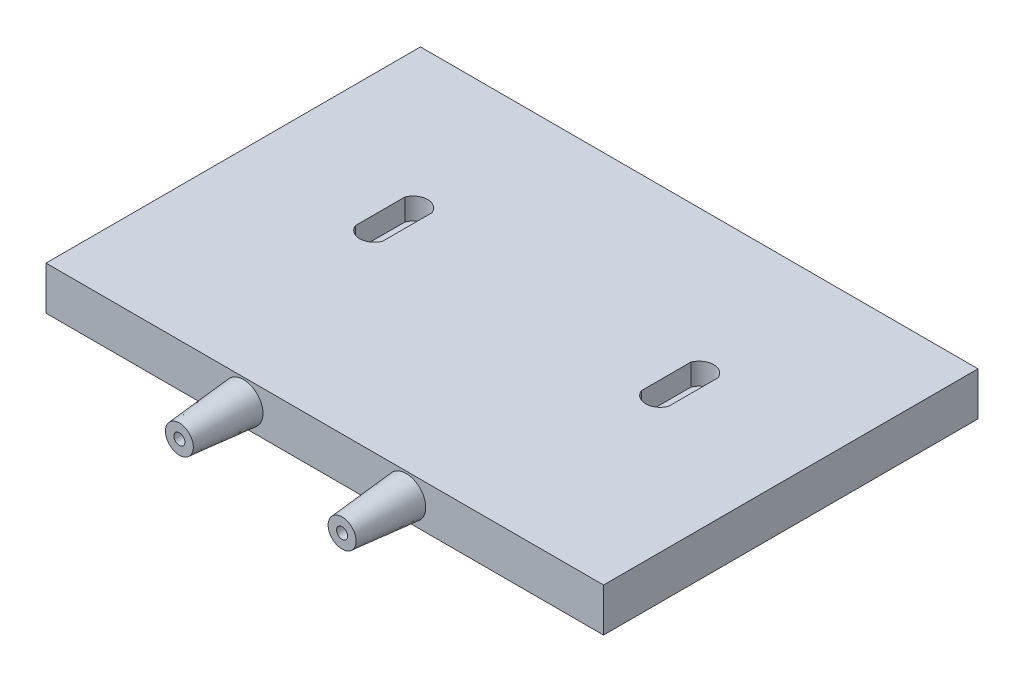
ISO-10303-21;
HEADER;
FILE_DESCRIPTION(('STEP AP214'),'2;1');
FILE_NAME('part.step','',(''),(''),'','','');
FILE_SCHEMA(('AUTOMOTIVE_DESIGN { 1 0 10303 214 1 1 1 1 }'));
ENDSEC;
DATA;
#1=APPLICATION_CONTEXT('core data for automotive mechanical design processes');
#2=APPLICATION_PROTOCOL_DEFINITION('international standard','automotive_design',2000,#1);
#3=PRODUCT_CONTEXT('',#1,'mechanical');
#4=PRODUCT('Part','Part','',(#3));
#5=PRODUCT_RELATED_PRODUCT_CATEGORY('part','',(#4));
#6=PRODUCT_DEFINITION_FORMATION('','',#4);
#7=PRODUCT_DEFINITION_CONTEXT('part definition',#1,'design');
#8=PRODUCT_DEFINITION('design','',#6,#7);
#9=PRODUCT_DEFINITION_SHAPE('','',#8);
#10=(LENGTH_UNIT() NAMED_UNIT(*) SI_UNIT(.MILLI.,.METRE.));
#11=(NAMED_UNIT(*) PLANE_ANGLE_UNIT() SI_UNIT($,.RADIAN.));
#12=(NAMED_UNIT(*) SI_UNIT($,.STERADIAN.) SOLID_ANGLE_UNIT());
#13=UNCERTAINTY_MEASURE_WITH_UNIT(LENGTH_MEASURE(1.E-05),#10,'distance_accuracy_value','');
#14=(GEOMETRIC_REPRESENTATION_CONTEXT(3) GLOBAL_UNCERTAINTY_ASSIGNED_CONTEXT((#13)) GLOBAL_UNIT_ASSIGNED_CONTEXT((#10,
#11,#12)) REPRESENTATION_CONTEXT('',''));
#15=CARTESIAN_POINT('',(0.,0.,0.));
#16=DIRECTION('',(0.,0.,1.));
#17=DIRECTION('',(1.,0.,0.));
#18=AXIS2_PLACEMENT_3D('',#15,#16,#17);
#19=CARTESIAN_POINT('',(-22.8749999999999,6.1,52.6359973136333));
#20=DIRECTION('',(0.,0.,-1.));
#21=DIRECTION('',(1.,0.,0.));
#22=AXIS2_PLACEMENT_3D('',#19,#20,#21);
#23=CONICAL_SURFACE('',#22,5.5,0.0872664625997165);
#24=CARTESIAN_POINT('',(-22.8749999999999,6.1,52.6359973136333));
#25=DIRECTION('',(0.,0.,-1.));
#26=DIRECTION('',(-1.,0.,0.));
#27=AXIS2_PLACEMENT_3D('',#24,#25,#26);
#28=CIRCLE('',#27,5.5);
#29=CARTESIAN_POINT('',(-28.3749999999999,6.1,52.6359973136333));
#30=VERTEX_POINT('',#29);
#31=EDGE_CURVE('E352',#30,#30,#28,.F.);
#32=ORIENTED_EDGE('',*,*,#31,.T.);
#33=EDGE_LOOP('',(#32));
#34=FACE_BOUND('',#33,.T.);
#35=CARTESIAN_POINT('',(-22.8749999999999,6.1,70.6359973136333));
#36=DIRECTION('',(0.,0.,1.));
#37=DIRECTION('',(1.,0.,0.));
#38=AXIS2_PLACEMENT_3D('',#35,#36,#37);
#39=CIRCLE('',#38,3.92520405653336);
#40=CARTESIAN_POINT('',(-18.9497959434666,6.1,70.6359973136333));
#41=VERTEX_POINT('',#40);
#42=EDGE_CURVE('E256',#41,#41,#39,.T.);
#43=ORIENTED_EDGE('',*,*,#42,.F.);
#44=EDGE_LOOP('',(#43));
#45=FACE_BOUND('',#44,.T.);
#46=CARTESIAN_POINT('',(-26.3749999999999,4.17210871809767,69.8285854690584));
#47=CARTESIAN_POINT('',(-26.3749999999999,4.11745942982969,69.5269976381816));
#48=CARTESIAN_POINT('',(-26.3749999999999,4.06446248035971,69.2251163527461));
#49=CARTESIAN_POINT('',(-26.3749999999999,3.96123087004707,68.6208892731655));
#50=CARTESIAN_POINT('',(-26.3749999999999,3.9109961356524,68.3185434916094));
#51=CARTESIAN_POINT('',(-26.3749999999999,3.81274798337831,67.7135200384658));
#52=CARTESIAN_POINT('',(-26.3749999999999,3.76473437277168,67.4108423980156));
#53=CARTESIAN_POINT('',(-26.3749999999999,3.67056684298433,66.8051961446706));
#54=CARTESIAN_POINT('',(-26.3749999999999,3.62441293829521,66.5022275295271));
#55=CARTESIAN_POINT('',(-26.3749999999999,3.48831477248816,65.5930914334059));
#56=CARTESIAN_POINT('',(-26.3749999999999,3.40071471504929,64.9865729981366));
#57=CARTESIAN_POINT('',(-26.3749999999999,3.23016743796715,63.7728702574676));
#58=CARTESIAN_POINT('',(-26.3749999999999,3.14722034779906,63.1656859340175));
#59=CARTESIAN_POINT('',(-26.3749999999999,2.98491601388755,61.950561728038));
#60=CARTESIAN_POINT('',(-26.3749999999999,2.90556039647342,61.3426216288001));
#61=CARTESIAN_POINT('',(-26.3749999999999,2.74975750285684,60.126368515576));
#62=CARTESIAN_POINT('',(-26.3749999999999,2.67331023423791,59.5180555006216));
#63=CARTESIAN_POINT('',(-26.3749999999999,2.44750949646066,57.6926767682325));
#64=CARTESIAN_POINT('',(-26.3749999999999,2.30169733858322,56.4751732114865));
#65=CARTESIAN_POINT('',(-26.3749999999999,2.01663971682371,54.0389161870429));
#66=CARTESIAN_POINT('',(-26.3749999999999,1.87739686896342,52.8201624156162));
#67=CARTESIAN_POINT('',(-26.3749999999999,1.67224553648955,50.9916372554584));
#68=CARTESIAN_POINT('',(-26.3749999999999,1.6044816752983,50.3820732311682));
#69=CARTESIAN_POINT('',(-26.3749999999999,1.47004371275973,49.162826215269));
#70=CARTESIAN_POINT('',(-26.3749999999999,1.40336960922725,48.5531432239012));
#71=CARTESIAN_POINT('',(-26.3749999999999,1.33716672483393,47.9434091582082));
#72=B_SPLINE_CURVE_WITH_KNOTS('',3,(#46,#47,#48,#49,#50,#51,#52,#53,#54,#55,#56,#57,#58,#59,#60,
#61,#62,#63,#64,#65,#66,#67,#68,#69,#70,#71),.UNSPECIFIED.,.F.,.F.,(4,2,2,2,2,2,2,2,2,2,2,2,4),
(0.,0.91948455837307,1.83894462092231,2.75832475157389,3.67771204503739,5.51611992035932,
7.3545789265392,9.19386227997452,11.0331504290127,14.7117323193549,18.3917669342644,
20.2317232111315,22.0716757980903),.UNSPECIFIED.);
#73=CARTESIAN_POINT('',(-26.3749999999999,2.81505393507992,60.6359973136333));
#74=VERTEX_POINT('',#73);
#75=CARTESIAN_POINT('',(-26.3749999999999,2.38189429319995,57.1359973136333));
#76=VERTEX_POINT('',#75);
#77=EDGE_CURVE('E11',#74,#76,#72,.T.);
#78=ORIENTED_EDGE('',*,*,#77,.F.);
#79=CARTESIAN_POINT('',(-22.8749999999999,6.1,60.6359973136333));
#80=DIRECTION('',(0.,0.,-1.));
#81=DIRECTION('',(-1.,0.,0.));
#82=AXIS2_PLACEMENT_3D('',#79,#80,#81);
#83=CIRCLE('',#82,4.8000906917926);
#84=CARTESIAN_POINT('',(-19.3749999999999,2.81505393507991,60.6359973136333));
#85=VERTEX_POINT('',#84);
#86=EDGE_CURVE('E198',#85,#74,#83,.T.);
#87=ORIENTED_EDGE('',*,*,#86,.F.);
#88=CARTESIAN_POINT('',(-19.3749999999999,1.33716672483392,47.9434091582082));
#89=CARTESIAN_POINT('',(-19.3749999999999,1.43500962840932,48.844351854817));
#90=CARTESIAN_POINT('',(-19.3749999999999,1.53384689658539,49.7451881265944));
#91=CARTESIAN_POINT('',(-19.3749999999999,1.73406321961327,51.5465669491305));
#92=CARTESIAN_POINT('',(-19.3749999999999,1.83544224393583,52.4471095032856));
#93=CARTESIAN_POINT('',(-19.3749999999999,2.04127619907767,54.2476556788387));
#94=CARTESIAN_POINT('',(-19.3749999999999,2.14573049022473,55.1476593731346));
#95=CARTESIAN_POINT('',(-19.3749999999999,2.35855843869986,56.9472195360648));
#96=CARTESIAN_POINT('',(-19.3749999999999,2.46693216248866,57.846775996853));
#97=CARTESIAN_POINT('',(-19.3749999999999,2.69205036720925,59.6720549838711));
#98=CARTESIAN_POINT('',(-19.3749999999999,2.80894803278661,60.5977587568576));
#99=CARTESIAN_POINT('',(-19.3749999999999,2.98981211234068,61.9855761544224));
#100=CARTESIAN_POINT('',(-19.3749999999999,3.0510184308723,62.4480494832672));
#101=CARTESIAN_POINT('',(-19.3749999999999,3.17564137614589,63.3727017550615));
#102=CARTESIAN_POINT('',(-19.3749999999999,3.23905801587242,63.8348806962655));
#103=CARTESIAN_POINT('',(-19.3749999999999,3.36858423900071,64.758971624193));
#104=CARTESIAN_POINT('',(-19.3749999999999,3.43469444400984,65.2208835240601));
#105=CARTESIAN_POINT('',(-19.3749999999999,3.57024116419512,66.1442126160202));
#106=CARTESIAN_POINT('',(-19.3749999999999,3.6396776245076,66.6056298161447));
#107=CARTESIAN_POINT('',(-19.3749999999999,3.78280263295804,67.5278740895825));
#108=CARTESIAN_POINT('',(-19.3749999999999,3.85649176054285,67.9887010736904));
#109=CARTESIAN_POINT('',(-19.3749999999999,3.97126229074893,68.6792510157885));
#110=CARTESIAN_POINT('',(-19.3749999999999,4.01022642101928,68.9093256550331));
#111=CARTESIAN_POINT('',(-19.3749999999999,4.08983772132458,69.3691868112572));
#112=CARTESIAN_POINT('',(-19.3749999999999,4.130484916852,69.5989733238181));
#113=CARTESIAN_POINT('',(-19.3749999999999,4.17210871809766,69.8285854690584));
#114=B_SPLINE_CURVE_WITH_KNOTS('',3,(#88,#89,#90,#91,#92,#93,#94,#95,#96,#97,#98,#99,#100,#101,
#102,#103,#104,#105,#106,#107,#108,#109,#110,#111,#112,#113),.UNSPECIFIED.,.F.,.F.,(4,2,2,2,2,2,
2,2,2,2,2,2,4),(0.,2.7187218020045,5.43741096484029,8.15553856620453,10.8737122797325,
13.6728538729671,15.0723675720148,16.4718894939034,17.8717362403286,19.2715599054532,
20.6715747558415,21.3716212738195,22.0716783989049),.UNSPECIFIED.);
#115=CARTESIAN_POINT('',(-19.3749999999999,2.38189429319994,57.1359973136333));
#116=VERTEX_POINT('',#115);
#117=EDGE_CURVE('E50',#116,#85,#114,.T.);
#118=ORIENTED_EDGE('',*,*,#117,.F.);
#119=CARTESIAN_POINT('',(-22.8749999999999,6.1,57.1359973136333));
#120=DIRECTION('',(0.,0.,1.));
#121=DIRECTION('',(1.,0.,0.));
#122=AXIS2_PLACEMENT_3D('',#119,#120,#121);
#123=CIRCLE('',#122,5.10630101413334);
#124=EDGE_CURVE('E203',#76,#116,#123,.T.);
#125=ORIENTED_EDGE('',*,*,#124,.F.);
#126=EDGE_LOOP('',(#78,#87,#118,#125));
#127=FACE_BOUND('',#126,.T.);
#128=ADVANCED_FACE('F36',(#34,#45,#127),#23,.T.);
#129=CARTESIAN_POINT('',(22.875,6.10000000000021,52.6359973136333));
#130=DIRECTION('',(0.,0.,-1.));
#131=DIRECTION('',(-1.,0.,0.));
#132=AXIS2_PLACEMENT_3D('',#129,#130,#131);
#133=CONICAL_SURFACE('',#132,5.5,0.0872664625997165);
#134=CARTESIAN_POINT('',(22.875,6.10000000000021,70.6359973136333));
#135=DIRECTION('',(0.,0.,-1.));
#136=DIRECTION('',(-1.,0.,0.));
#137=AXIS2_PLACEMENT_3D('',#134,#135,#136);
#138=CIRCLE('',#137,3.92520405653336);
#139=CARTESIAN_POINT('',(18.9497959434666,6.10000000000021,70.6359973136333));
#140=VERTEX_POINT('',#139);
#141=EDGE_CURVE('E246',#140,#140,#138,.T.);
#142=ORIENTED_EDGE('',*,*,#141,.T.);
#143=EDGE_LOOP('',(#142));
#144=FACE_BOUND('',#143,.T.);
#145=CARTESIAN_POINT('',(22.875,6.10000000000021,52.6359973136333));
#146=DIRECTION('',(0.,0.,-1.));
#147=DIRECTION('',(-1.,0.,0.));
#148=AXIS2_PLACEMENT_3D('',#145,#146,#147);
#149=CIRCLE('',#148,5.5);
#150=CARTESIAN_POINT('',(17.375,6.10000000000021,52.6359973136333));
#151=VERTEX_POINT('',#150);
#152=EDGE_CURVE('E253',#151,#151,#149,.T.);
#153=ORIENTED_EDGE('',*,*,#152,.F.);
#154=EDGE_LOOP('',(#153));
#155=FACE_BOUND('',#154,.T.);
#156=CARTESIAN_POINT('',(19.3749999999999,1.33716672483419,47.9434091582084));
#157=CARTESIAN_POINT('',(19.3749999999999,1.4350096284096,48.8443518548172));
#158=CARTESIAN_POINT('',(19.3749999999999,1.53384689658566,49.7451881265946));
#159=CARTESIAN_POINT('',(19.3749999999999,1.73406321961355,51.5465669491307));
#160=CARTESIAN_POINT('',(19.3749999999999,1.83544224393611,52.4471095032858));
#161=CARTESIAN_POINT('',(19.3749999999999,2.04127619907795,54.2476556788389));
#162=CARTESIAN_POINT('',(19.3749999999999,2.145730490225,55.1476593731347));
#163=CARTESIAN_POINT('',(19.3749999999999,2.35855843870014,56.9472195360649));
#164=CARTESIAN_POINT('',(19.3749999999999,2.46693216248894,57.8467759968532));
#165=CARTESIAN_POINT('',(19.3749999999999,2.69205036720953,59.6720549838712));
#166=CARTESIAN_POINT('',(19.3749999999999,2.80894803278689,60.5977587568577));
#167=CARTESIAN_POINT('',(19.3749999999999,2.98981211234096,61.9855761544225));
#168=CARTESIAN_POINT('',(19.3749999999999,3.05101843087257,62.4480494832672));
#169=CARTESIAN_POINT('',(19.3749999999999,3.17564137614617,63.3727017550616));
#170=CARTESIAN_POINT('',(19.3749999999999,3.2390580158727,63.8348806962656));
#171=CARTESIAN_POINT('',(19.3749999999999,3.36858423900098,64.758971624193));
#172=CARTESIAN_POINT('',(19.3749999999999,3.43469444401012,65.22088352406));
#173=CARTESIAN_POINT('',(19.3749999999999,3.5702411641954,66.1442126160201));
#174=CARTESIAN_POINT('',(19.3749999999999,3.63967762450788,66.6056298161446));
#175=CARTESIAN_POINT('',(19.3749999999999,3.78280263295832,67.5278740895824));
#176=CARTESIAN_POINT('',(19.3749999999999,3.85649176054313,67.9887010736903));
#177=CARTESIAN_POINT('',(19.3749999999999,3.97126229074921,68.6792510157883));
#178=CARTESIAN_POINT('',(19.3749999999999,4.01022642101956,68.909325655033));
#179=CARTESIAN_POINT('',(19.3749999999999,4.08983772132486,69.369186811257));
#180=CARTESIAN_POINT('',(19.3749999999999,4.13048491685228,69.598973323818));
#181=CARTESIAN_POINT('',(19.3749999999999,4.17210871809794,69.8285854690583));
#182=B_SPLINE_CURVE_WITH_KNOTS('',3,(#156,#157,#158,#159,#160,#161,#162,#163,#164,#165,#166,
#167,#168,#169,#170,#171,#172,#173,#174,#175,#176,#177,#178,#179,#180,#181),.UNSPECIFIED.,.F.,
.F.,(4,2,2,2,2,2,2,2,2,2,2,2,4),(0.,2.7187218020045,5.43741096484028,8.1555385662045,
10.8737122797325,13.672853872967,15.0723675720146,16.4718894939032,17.8717362403284,
19.2715599054529,20.6715747558411,21.3716212738192,22.0716783989045),.UNSPECIFIED.);
#183=CARTESIAN_POINT('',(19.3749999999999,2.3818942932002,57.1359973136333));
#184=VERTEX_POINT('',#183);
#185=CARTESIAN_POINT('',(19.3749999999999,2.81505393508006,60.6359973136334));
#186=VERTEX_POINT('',#185);
#187=EDGE_CURVE('E354',#184,#186,#182,.T.);
#188=ORIENTED_EDGE('',*,*,#187,.T.);
#189=CARTESIAN_POINT('',(22.875,6.10000000000021,60.6359973136333));
#190=DIRECTION('',(0.,0.,-1.));
#191=DIRECTION('',(-1.,0.,0.));
#192=AXIS2_PLACEMENT_3D('',#189,#190,#191);
#193=CIRCLE('',#192,4.8000906917926);
#194=CARTESIAN_POINT('',(26.3749999999999,2.81505393508006,60.6359973136333));
#195=VERTEX_POINT('',#194);
#196=EDGE_CURVE('E235',#186,#195,#193,.F.);
#197=ORIENTED_EDGE('',*,*,#196,.T.);
#198=CARTESIAN_POINT('',(26.3749999999999,4.17210871809775,69.8285854690582));
#199=CARTESIAN_POINT('',(26.3749999999999,4.11745942982977,69.5269976381814));
#200=CARTESIAN_POINT('',(26.3749999999999,4.06446248035979,69.2251163527459));
#201=CARTESIAN_POINT('',(26.3749999999999,3.96123087004716,68.6208892731653));
#202=CARTESIAN_POINT('',(26.3749999999999,3.91099613565249,68.3185434916092));
#203=CARTESIAN_POINT('',(26.3749999999999,3.8127479833784,67.7135200384656));
#204=CARTESIAN_POINT('',(26.3749999999999,3.76473437277178,67.4108423980154));
#205=CARTESIAN_POINT('',(26.3749999999999,3.67056684298443,66.8051961446704));
#206=CARTESIAN_POINT('',(26.3749999999999,3.62441293829532,66.5022275295269));
#207=CARTESIAN_POINT('',(26.3749999999999,3.48831477248826,65.5930914334057));
#208=CARTESIAN_POINT('',(26.3749999999999,3.40071471504939,64.9865729981364));
#209=CARTESIAN_POINT('',(26.3749999999999,3.23016743796727,63.7728702574674));
#210=CARTESIAN_POINT('',(26.3749999999999,3.14722034779917,63.1656859340173));
#211=CARTESIAN_POINT('',(26.3749999999999,2.98491601388767,61.9505617280378));
#212=CARTESIAN_POINT('',(26.3749999999999,2.90556039647355,61.3426216287999));
#213=CARTESIAN_POINT('',(26.3749999999999,2.74975750285697,60.1263685155759));
#214=CARTESIAN_POINT('',(26.3749999999999,2.67331023423804,59.5180555006215));
#215=CARTESIAN_POINT('',(26.3749999999999,2.4475094964608,57.6926767682324));
#216=CARTESIAN_POINT('',(26.3749999999999,2.30169733858338,56.4751732114864));
#217=CARTESIAN_POINT('',(26.3749999999999,2.01663971682388,54.0389161870429));
#218=CARTESIAN_POINT('',(26.3749999999999,1.87739686896359,52.8201624156163));
#219=CARTESIAN_POINT('',(26.3749999999999,1.67224553648973,50.9916372554585));
#220=CARTESIAN_POINT('',(26.3749999999999,1.60448167529848,50.3820732311683));
#221=CARTESIAN_POINT('',(26.3749999999999,1.47004371275992,49.1628262152692));
#222=CARTESIAN_POINT('',(26.3749999999999,1.40336960922744,48.5531432239014));
#223=CARTESIAN_POINT('',(26.3749999999999,1.33716672483412,47.9434091582084));
#224=B_SPLINE_CURVE_WITH_KNOTS('',3,(#198,#199,#200,#201,#202,#203,#204,#205,#206,#207,#208,
#209,#210,#211,#212,#213,#214,#215,#216,#217,#218,#219,#220,#221,#222,#223),.UNSPECIFIED.,.F.,
.F.,(4,2,2,2,2,2,2,2,2,2,2,2,4),(0.,0.919484558373068,1.8389446209223,2.7583247515739,
3.67771204503739,5.51611992035932,7.35457892653922,9.19386227997449,11.0331504290126,
14.7117323193547,18.3917669342641,20.2317232111311,22.0716757980899),.UNSPECIFIED.);
#225=CARTESIAN_POINT('',(26.3749999999999,2.38189429320011,57.1359973136333));
#226=VERTEX_POINT('',#225);
#227=EDGE_CURVE('E370',#195,#226,#224,.T.);
#228=ORIENTED_EDGE('',*,*,#227,.T.);
#229=CARTESIAN_POINT('',(22.875,6.10000000000021,57.1359973136333));
#230=DIRECTION('',(0.,0.,1.));
#231=DIRECTION('',(1.,0.,0.));
#232=AXIS2_PLACEMENT_3D('',#229,#230,#231);
#233=CIRCLE('',#232,5.10630101413334);
#234=EDGE_CURVE('E231',#226,#184,#233,.F.);
#235=ORIENTED_EDGE('',*,*,#234,.T.);
#236=EDGE_LOOP('',(#188,#197,#228,#235));
#237=FACE_BOUND('',#236,.T.);
#238=ADVANCED_FACE('F376',(#144,#155,#237),#133,.T.);
#239=CARTESIAN_POINT('',(22.8750000000001,6.1,70.6369973136333));
#240=DIRECTION('',(0.,0.,-1.));
#241=DIRECTION('',(-1.,0.,0.));
#242=AXIS2_PLACEMENT_3D('',#239,#240,#241);
#243=CYLINDRICAL_SURFACE('',#242,1.55);
#244=CARTESIAN_POINT('',(22.8750000000001,6.1,70.6359973136333));
#245=DIRECTION('',(0.,0.,-1.));
#246=DIRECTION('',(-1.,0.,0.));
#247=AXIS2_PLACEMENT_3D('',#244,#245,#246);
#248=CIRCLE('',#247,1.55);
#249=CARTESIAN_POINT('',(21.3250000000001,6.1,70.6359973136333));
#250=VERTEX_POINT('',#249);
#251=EDGE_CURVE('E238',#250,#250,#248,.T.);
#252=ORIENTED_EDGE('',*,*,#251,.F.);
#253=EDGE_LOOP('',(#252));
#254=FACE_BOUND('',#253,.T.);
#255=CARTESIAN_POINT('',(22.8750000000001,6.1,60.6359973136333));
#256=DIRECTION('',(0.,0.,-1.));
#257=DIRECTION('',(-1.,0.,0.));
#258=AXIS2_PLACEMENT_3D('',#255,#256,#257);
#259=CIRCLE('',#258,1.55);
#260=CARTESIAN_POINT('',(21.3250000000001,6.1,60.6359973136333));
#261=VERTEX_POINT('',#260);
#262=EDGE_CURVE('E234',#261,#261,#259,.T.);
#263=ORIENTED_EDGE('',*,*,#262,.T.);
#264=EDGE_LOOP('',(#263));
#265=FACE_BOUND('',#264,.T.);
#266=ADVANCED_FACE('F407',(#254,#265),#243,.F.);
#267=CARTESIAN_POINT('',(-22.8749999999999,6.1,70.6369973136333));
#268=DIRECTION('',(0.,0.,-1.));
#269=DIRECTION('',(-1.,0.,0.));
#270=AXIS2_PLACEMENT_3D('',#267,#268,#269);
#271=CYLINDRICAL_SURFACE('',#270,1.55);
#272=CARTESIAN_POINT('',(-22.8749999999999,6.1,70.6359973136333));
#273=DIRECTION('',(0.,0.,1.));
#274=DIRECTION('',(1.,0.,0.));
#275=AXIS2_PLACEMENT_3D('',#272,#273,#274);
#276=CIRCLE('',#275,1.55);
#277=CARTESIAN_POINT('',(-21.3249999999999,6.1,70.6359973136333));
#278=VERTEX_POINT('',#277);
#279=EDGE_CURVE('E242',#278,#278,#276,.T.);
#280=ORIENTED_EDGE('',*,*,#279,.T.);
#281=EDGE_LOOP('',(#280));
#282=FACE_BOUND('',#281,.T.);
#283=CARTESIAN_POINT('',(-22.8749999999999,6.1,60.6359973136333));
#284=DIRECTION('',(0.,0.,-1.));
#285=DIRECTION('',(-1.,0.,0.));
#286=AXIS2_PLACEMENT_3D('',#283,#284,#285);
#287=CIRCLE('',#286,1.55);
#288=CARTESIAN_POINT('',(-24.4249999999999,6.1,60.6359973136333));
#289=VERTEX_POINT('',#288);
#290=EDGE_CURVE('E228',#289,#289,#287,.T.);
#291=ORIENTED_EDGE('',*,*,#290,.T.);
#292=EDGE_LOOP('',(#291));
#293=FACE_BOUND('',#292,.T.);
#294=ADVANCED_FACE('F403',(#282,#293),#271,.F.);
#295=CARTESIAN_POINT('',(0.,12.2,0.));
#296=DIRECTION('',(0.,1.,0.));
#297=DIRECTION('',(0.,0.,1.));
#298=AXIS2_PLACEMENT_3D('',#295,#296,#297);
#299=PLANE('',#298);
#300=CARTESIAN_POINT('',(40.1962091293442,12.2,-12.4004478708777));
#301=DIRECTION('',(0.,1.,0.));
#302=DIRECTION('',(0.,0.,1.));
#303=AXIS2_PLACEMENT_3D('',#300,#301,#302);
#304=CIRCLE('',#303,4.1);
#305=CARTESIAN_POINT('',(44.016,12.2,-13.8901450563667));
#306=VERTEX_POINT('',#305);
#307=CARTESIAN_POINT('',(36.3764182586883,12.2,-13.8901450563667));
#308=VERTEX_POINT('',#307);
#309=EDGE_CURVE('E259',#306,#308,#304,.T.);
#310=ORIENTED_EDGE('',*,*,#309,.F.);
#311=DIRECTION('',(0.,0.,1.));
#312=VECTOR('',#311,1.);
#313=CARTESIAN_POINT('',(44.0160000000001,12.2,0.));
#314=LINE('',#313,#312);
#315=CARTESIAN_POINT('',(44.0160000000001,12.2,-2.68636672628997E-06));
#316=VERTEX_POINT('',#315);
#317=EDGE_CURVE('E299',#306,#316,#314,.T.);
#318=ORIENTED_EDGE('',*,*,#317,.T.);
#319=CARTESIAN_POINT('',(40.1962091293442,12.2,-1.48969987185575));
#320=DIRECTION('',(0.,1.,0.));
#321=DIRECTION('',(0.,0.,1.));
#322=AXIS2_PLACEMENT_3D('',#319,#320,#321);
#323=CIRCLE('',#322,4.1);
#324=CARTESIAN_POINT('',(36.3764182586883,12.2,-2.68636671241218E-06));
#325=VERTEX_POINT('',#324);
#326=EDGE_CURVE('E311',#316,#325,#323,.F.);
#327=ORIENTED_EDGE('',*,*,#326,.T.);
#328=DIRECTION('',(0.,0.,1.));
#329=VECTOR('',#328,1.);
#330=CARTESIAN_POINT('',(36.3764182586883,12.2,0.));
#331=LINE('',#330,#329);
#332=EDGE_CURVE('E308',#308,#325,#331,.T.);
#333=ORIENTED_EDGE('',*,*,#332,.F.);
#334=EDGE_LOOP('',(#310,#318,#327,#333));
#335=FACE_BOUND('',#334,.T.);
#336=DIRECTION('',(0.,0.,-1.));
#337=VECTOR('',#336,1.);
#338=CARTESIAN_POINT('',(78.375,12.2,-52.6359973136333));
#339=LINE('',#338,#337);
#340=CARTESIAN_POINT('',(78.3750000000001,12.2,52.6359973136333));
#341=VERTEX_POINT('',#340);
#342=CARTESIAN_POINT('',(78.375,12.2,-52.6359973136333));
#343=VERTEX_POINT('',#342);
#344=EDGE_CURVE('E323',#341,#343,#339,.T.);
#345=ORIENTED_EDGE('',*,*,#344,.T.);
#346=DIRECTION('',(-1.,0.,0.));
#347=VECTOR('',#346,1.);
#348=CARTESIAN_POINT('',(-78.375,12.2,-52.6359973136333));
#349=LINE('',#348,#347);
#350=CARTESIAN_POINT('',(-78.375,12.2,-52.6359973136333));
#351=VERTEX_POINT('',#350);
#352=EDGE_CURVE('E326',#343,#351,#349,.T.);
#353=ORIENTED_EDGE('',*,*,#352,.T.);
#354=DIRECTION('',(0.,0.,1.));
#355=VECTOR('',#354,1.);
#356=CARTESIAN_POINT('',(-78.375,12.2,-52.6359973136333));
#357=LINE('',#356,#355);
#358=CARTESIAN_POINT('',(-78.3749999999999,12.2,52.6359973136333));
#359=VERTEX_POINT('',#358);
#360=EDGE_CURVE('E329',#351,#359,#357,.T.);
#361=ORIENTED_EDGE('',*,*,#360,.T.);
#362=DIRECTION('',(1.,0.,0.));
#363=VECTOR('',#362,1.);
#364=CARTESIAN_POINT('',(-78.3749999999999,12.2,52.6359973136333));
#365=LINE('',#364,#363);
#366=EDGE_CURVE('E331',#359,#341,#365,.T.);
#367=ORIENTED_EDGE('',*,*,#366,.T.);
#368=EDGE_LOOP('',(#345,#353,#361,#367));
#369=FACE_BOUND('',#368,.T.);
#370=DIRECTION('',(0.,0.,1.));
#371=VECTOR('',#370,1.);
#372=CARTESIAN_POINT('',(-44.016,12.2,0.));
#373=LINE('',#372,#371);
#374=CARTESIAN_POINT('',(-44.016,12.2,-13.8901450563667));
#375=VERTEX_POINT('',#374);
#376=CARTESIAN_POINT('',(-44.016,12.2,-2.68636669853439E-06));
#377=VERTEX_POINT('',#376);
#378=EDGE_CURVE('E276',#375,#377,#373,.T.);
#379=ORIENTED_EDGE('',*,*,#378,.F.);
#380=CARTESIAN_POINT('',(-40.1962091293441,12.2,-12.4004478708777));
#381=DIRECTION('',(0.,1.,0.));
#382=DIRECTION('',(0.,0.,1.));
#383=AXIS2_PLACEMENT_3D('',#380,#381,#382);
#384=CIRCLE('',#383,4.1);
#385=CARTESIAN_POINT('',(-36.3764182586882,12.2,-13.8901450563667));
#386=VERTEX_POINT('',#385);
#387=EDGE_CURVE('E273',#375,#386,#384,.F.);
#388=ORIENTED_EDGE('',*,*,#387,.T.);
#389=DIRECTION('',(0.,0.,1.));
#390=VECTOR('',#389,1.);
#391=CARTESIAN_POINT('',(-36.3764182586882,12.2,0.));
#392=LINE('',#391,#390);
#393=CARTESIAN_POINT('',(-36.3764182586882,12.2,-2.68636669853439E-06));
#394=VERTEX_POINT('',#393);
#395=EDGE_CURVE('E264',#386,#394,#392,.T.);
#396=ORIENTED_EDGE('',*,*,#395,.T.);
#397=CARTESIAN_POINT('',(-40.1962091293441,12.2,-1.48969987185572));
#398=DIRECTION('',(0.,1.,0.));
#399=DIRECTION('',(0.,0.,1.));
#400=AXIS2_PLACEMENT_3D('',#397,#398,#399);
#401=CIRCLE('',#400,4.1);
#402=EDGE_CURVE('E280',#377,#394,#401,.T.);
#403=ORIENTED_EDGE('',*,*,#402,.F.);
#404=EDGE_LOOP('',(#379,#388,#396,#403));
#405=FACE_BOUND('',#404,.T.);
#406=ADVANCED_FACE('F406',(#335,#369,#405),#299,.T.);
#407=CARTESIAN_POINT('',(78.375,12.2,-52.6359973136333));
#408=DIRECTION('',(-1.,0.,0.));
#409=DIRECTION('',(0.,0.,1.));
#410=AXIS2_PLACEMENT_3D('',#407,#408,#409);
#411=PLANE('',#410);
#412=DIRECTION('',(0.,0.,-1.));
#413=VECTOR('',#412,1.);
#414=CARTESIAN_POINT('',(78.375,0.,-52.6359973136333));
#415=LINE('',#414,#413);
#416=CARTESIAN_POINT('',(78.3750000000001,0.,52.6359973136333));
#417=VERTEX_POINT('',#416);
#418=CARTESIAN_POINT('',(78.375,0.,-52.6359973136333));
#419=VERTEX_POINT('',#418);
#420=EDGE_CURVE('E288',#417,#419,#415,.T.);
#421=ORIENTED_EDGE('',*,*,#420,.T.);
#422=DIRECTION('',(0.,-1.,0.));
#423=VECTOR('',#422,1.);
#424=CARTESIAN_POINT('',(78.375,12.2,-52.6359973136333));
#425=LINE('',#424,#423);
#426=EDGE_CURVE('E349',#343,#419,#425,.T.);
#427=ORIENTED_EDGE('',*,*,#426,.F.);
#428=ORIENTED_EDGE('',*,*,#344,.F.);
#429=DIRECTION('',(0.,-1.,0.));
#430=VECTOR('',#429,1.);
#431=CARTESIAN_POINT('',(78.3750000000001,12.2,52.6359973136333));
#432=LINE('',#431,#430);
#433=EDGE_CURVE('E333',#341,#417,#432,.T.);
#434=ORIENTED_EDGE('',*,*,#433,.T.);
#435=EDGE_LOOP('',(#421,#427,#428,#434));
#436=FACE_BOUND('',#435,.T.);
#437=ADVANCED_FACE('F38',(#436),#411,.F.);
#438=CARTESIAN_POINT('',(-78.375,12.2,-52.6359973136333));
#439=DIRECTION('',(0.,0.,1.));
#440=DIRECTION('',(1.,0.,0.));
#441=AXIS2_PLACEMENT_3D('',#438,#439,#440);
#442=PLANE('',#441);
#443=DIRECTION('',(-1.,0.,0.));
#444=VECTOR('',#443,1.);
#445=CARTESIAN_POINT('',(-78.375,0.,-52.6359973136333));
#446=LINE('',#445,#444);
#447=CARTESIAN_POINT('',(-78.375,0.,-52.6359973136333));
#448=VERTEX_POINT('',#447);
#449=EDGE_CURVE('E336',#419,#448,#446,.T.);
#450=ORIENTED_EDGE('',*,*,#449,.T.);
#451=DIRECTION('',(0.,-1.,0.));
#452=VECTOR('',#451,1.);
#453=CARTESIAN_POINT('',(-78.375,12.2,-52.6359973136333));
#454=LINE('',#453,#452);
#455=EDGE_CURVE('E346',#351,#448,#454,.T.);
#456=ORIENTED_EDGE('',*,*,#455,.F.);
#457=ORIENTED_EDGE('',*,*,#352,.F.);
#458=ORIENTED_EDGE('',*,*,#426,.T.);
#459=EDGE_LOOP('',(#450,#456,#457,#458));
#460=FACE_BOUND('',#459,.T.);
#461=ADVANCED_FACE('F698',(#460),#442,.F.);
#462=CARTESIAN_POINT('',(-78.375,12.2,-52.6359973136333));
#463=DIRECTION('',(1.,0.,0.));
#464=DIRECTION('',(0.,0.,-1.));
#465=AXIS2_PLACEMENT_3D('',#462,#463,#464);
#466=PLANE('',#465);
#467=DIRECTION('',(0.,0.,1.));
#468=VECTOR('',#467,1.);
#469=CARTESIAN_POINT('',(-78.375,0.,-52.6359973136333));
#470=LINE('',#469,#468);
#471=CARTESIAN_POINT('',(-78.3749999999999,0.,52.6359973136333));
#472=VERTEX_POINT('',#471);
#473=EDGE_CURVE('E338',#448,#472,#470,.T.);
#474=ORIENTED_EDGE('',*,*,#473,.T.);
#475=DIRECTION('',(0.,-1.,0.));
#476=VECTOR('',#475,1.);
#477=CARTESIAN_POINT('',(-78.3749999999999,12.2,52.6359973136333));
#478=LINE('',#477,#476);
#479=EDGE_CURVE('E343',#359,#472,#478,.T.);
#480=ORIENTED_EDGE('',*,*,#479,.F.);
#481=ORIENTED_EDGE('',*,*,#360,.F.);
#482=ORIENTED_EDGE('',*,*,#455,.T.);
#483=EDGE_LOOP('',(#474,#480,#481,#482));
#484=FACE_BOUND('',#483,.T.);
#485=ADVANCED_FACE('F691',(#484),#466,.F.);
#486=CARTESIAN_POINT('',(-78.3749999999999,12.2,52.6359973136333));
#487=DIRECTION('',(0.,0.,-1.));
#488=DIRECTION('',(-1.,0.,0.));
#489=AXIS2_PLACEMENT_3D('',#486,#487,#488);
#490=PLANE('',#489);
#491=ORIENTED_EDGE('',*,*,#152,.T.);
#492=EDGE_LOOP('',(#491));
#493=FACE_BOUND('',#492,.T.);
#494=ORIENTED_EDGE('',*,*,#31,.F.);
#495=EDGE_LOOP('',(#494));
#496=FACE_BOUND('',#495,.T.);
#497=DIRECTION('',(1.,0.,0.));
#498=VECTOR('',#497,1.);
#499=CARTESIAN_POINT('',(-78.3749999999999,0.,52.6359973136333));
#500=LINE('',#499,#498);
#501=EDGE_CURVE('E327',#472,#417,#500,.T.);
#502=ORIENTED_EDGE('',*,*,#501,.T.);
#503=ORIENTED_EDGE('',*,*,#433,.F.);
#504=ORIENTED_EDGE('',*,*,#366,.F.);
#505=ORIENTED_EDGE('',*,*,#479,.T.);
#506=EDGE_LOOP('',(#502,#503,#504,#505));
#507=FACE_BOUND('',#506,.T.);
#508=ADVANCED_FACE('F683',(#493,#496,#507),#490,.F.);
#509=CARTESIAN_POINT('',(0.,0.,0.));
#510=DIRECTION('',(0.,1.,0.));
#511=DIRECTION('',(0.,0.,1.));
#512=AXIS2_PLACEMENT_3D('',#509,#510,#511);
#513=PLANE('',#512);
#514=ORIENTED_EDGE('',*,*,#420,.F.);
#515=ORIENTED_EDGE('',*,*,#501,.F.);
#516=ORIENTED_EDGE('',*,*,#473,.F.);
#517=ORIENTED_EDGE('',*,*,#449,.F.);
#518=EDGE_LOOP('',(#514,#515,#516,#517));
#519=FACE_BOUND('',#518,.T.);
#520=ADVANCED_FACE('F674',(#519),#513,.F.);
#521=CARTESIAN_POINT('',(40.1962091293442,6.1,-12.4004478708777));
#522=DIRECTION('',(0.,1.,0.));
#523=DIRECTION('',(0.,0.,1.));
#524=AXIS2_PLACEMENT_3D('',#521,#522,#523);
#525=CYLINDRICAL_SURFACE('',#524,4.1);
#526=ORIENTED_EDGE('',*,*,#309,.T.);
#527=DIRECTION('',(0.,1.,0.));
#528=VECTOR('',#527,1.);
#529=CARTESIAN_POINT('',(36.3764182586883,6.1,-13.8901450563667));
#530=LINE('',#529,#528);
#531=CARTESIAN_POINT('',(36.3764182586883,6.1,-13.8901450563667));
#532=VERTEX_POINT('',#531);
#533=EDGE_CURVE('E306',#532,#308,#530,.T.);
#534=ORIENTED_EDGE('',*,*,#533,.F.);
#535=CARTESIAN_POINT('',(40.1962091293442,6.1,-12.4004478708777));
#536=DIRECTION('',(0.,1.,0.));
#537=DIRECTION('',(0.,0.,1.));
#538=AXIS2_PLACEMENT_3D('',#535,#536,#537);
#539=CIRCLE('',#538,4.1);
#540=CARTESIAN_POINT('',(44.016,6.1,-13.8901450563667));
#541=VERTEX_POINT('',#540);
#542=EDGE_CURVE('E295',#541,#532,#539,.T.);
#543=ORIENTED_EDGE('',*,*,#542,.F.);
#544=DIRECTION('',(0.,1.,0.));
#545=VECTOR('',#544,1.);
#546=CARTESIAN_POINT('',(44.016,6.1,-13.8901450563667));
#547=LINE('',#546,#545);
#548=EDGE_CURVE('E277',#541,#306,#547,.T.);
#549=ORIENTED_EDGE('',*,*,#548,.T.);
#550=EDGE_LOOP('',(#526,#534,#543,#549));
#551=FACE_BOUND('',#550,.T.);
#552=ADVANCED_FACE('F666',(#551),#525,.F.);
#553=CARTESIAN_POINT('',(44.0160000000001,6.1,0.));
#554=DIRECTION('',(-1.,0.,0.));
#555=DIRECTION('',(0.,0.,1.));
#556=AXIS2_PLACEMENT_3D('',#553,#554,#555);
#557=PLANE('',#556);
#558=ORIENTED_EDGE('',*,*,#317,.F.);
#559=ORIENTED_EDGE('',*,*,#548,.F.);
#560=DIRECTION('',(0.,0.,1.));
#561=VECTOR('',#560,1.);
#562=CARTESIAN_POINT('',(44.0160000000001,6.1,0.));
#563=LINE('',#562,#561);
#564=CARTESIAN_POINT('',(44.0160000000001,6.1,-2.68636672628997E-06));
#565=VERTEX_POINT('',#564);
#566=EDGE_CURVE('E304',#541,#565,#563,.T.);
#567=ORIENTED_EDGE('',*,*,#566,.T.);
#568=DIRECTION('',(0.,1.,0.));
#569=VECTOR('',#568,1.);
#570=CARTESIAN_POINT('',(44.0160000000001,6.1,-2.68636672628997E-06));
#571=LINE('',#570,#569);
#572=EDGE_CURVE('E317',#565,#316,#571,.T.);
#573=ORIENTED_EDGE('',*,*,#572,.T.);
#574=EDGE_LOOP('',(#558,#559,#567,#573));
#575=FACE_BOUND('',#574,.T.);
#576=ADVANCED_FACE('F658',(#575),#557,.T.);
#577=CARTESIAN_POINT('',(40.1962091293442,6.1,-1.48969987185575));
#578=DIRECTION('',(0.,1.,0.));
#579=DIRECTION('',(0.,0.,1.));
#580=AXIS2_PLACEMENT_3D('',#577,#578,#579);
#581=CYLINDRICAL_SURFACE('',#580,4.1);
#582=ORIENTED_EDGE('',*,*,#326,.F.);
#583=ORIENTED_EDGE('',*,*,#572,.F.);
#584=CARTESIAN_POINT('',(40.1962091293442,6.1,-1.48969987185575));
#585=DIRECTION('',(0.,1.,0.));
#586=DIRECTION('',(0.,0.,1.));
#587=AXIS2_PLACEMENT_3D('',#584,#585,#586);
#588=CIRCLE('',#587,4.1);
#589=CARTESIAN_POINT('',(36.3764182586883,6.1,-2.68636671241218E-06));
#590=VERTEX_POINT('',#589);
#591=EDGE_CURVE('E302',#565,#590,#588,.F.);
#592=ORIENTED_EDGE('',*,*,#591,.T.);
#593=DIRECTION('',(0.,1.,0.));
#594=VECTOR('',#593,1.);
#595=CARTESIAN_POINT('',(36.3764182586883,6.1,-2.68636671241218E-06));
#596=LINE('',#595,#594);
#597=EDGE_CURVE('E319',#590,#325,#596,.T.);
#598=ORIENTED_EDGE('',*,*,#597,.T.);
#599=EDGE_LOOP('',(#582,#583,#592,#598));
#600=FACE_BOUND('',#599,.T.);
#601=ADVANCED_FACE('F650',(#600),#581,.F.);
#602=CARTESIAN_POINT('',(36.3764182586883,6.1,0.));
#603=DIRECTION('',(-1.,0.,0.));
#604=DIRECTION('',(0.,0.,1.));
#605=AXIS2_PLACEMENT_3D('',#602,#603,#604);
#606=PLANE('',#605);
#607=ORIENTED_EDGE('',*,*,#332,.T.);
#608=ORIENTED_EDGE('',*,*,#597,.F.);
#609=DIRECTION('',(0.,0.,1.));
#610=VECTOR('',#609,1.);
#611=CARTESIAN_POINT('',(36.3764182586883,6.1,0.));
#612=LINE('',#611,#610);
#613=EDGE_CURVE('E298',#532,#590,#612,.T.);
#614=ORIENTED_EDGE('',*,*,#613,.F.);
#615=ORIENTED_EDGE('',*,*,#533,.T.);
#616=EDGE_LOOP('',(#607,#608,#614,#615));
#617=FACE_BOUND('',#616,.T.);
#618=ADVANCED_FACE('F642',(#617),#606,.F.);
#619=CARTESIAN_POINT('',(0.,6.1,0.));
#620=DIRECTION('',(0.,1.,0.));
#621=DIRECTION('',(0.,0.,1.));
#622=AXIS2_PLACEMENT_3D('',#619,#620,#621);
#623=PLANE('',#622);
#624=ORIENTED_EDGE('',*,*,#542,.T.);
#625=ORIENTED_EDGE('',*,*,#613,.T.);
#626=ORIENTED_EDGE('',*,*,#591,.F.);
#627=ORIENTED_EDGE('',*,*,#566,.F.);
#628=EDGE_LOOP('',(#624,#625,#626,#627));
#629=FACE_BOUND('',#628,.T.);
#630=ADVANCED_FACE('F634',(#629),#623,.T.);
#631=CARTESIAN_POINT('',(-40.1962091293441,6.1,-12.4004478708777));
#632=DIRECTION('',(0.,1.,0.));
#633=DIRECTION('',(0.,0.,1.));
#634=AXIS2_PLACEMENT_3D('',#631,#632,#633);
#635=CYLINDRICAL_SURFACE('',#634,4.1);
#636=ORIENTED_EDGE('',*,*,#387,.F.);
#637=DIRECTION('',(0.,1.,0.));
#638=VECTOR('',#637,1.);
#639=CARTESIAN_POINT('',(-44.016,6.1,-13.8901450563667));
#640=LINE('',#639,#638);
#641=CARTESIAN_POINT('',(-44.016,6.1,-13.8901450563667));
#642=VERTEX_POINT('',#641);
#643=EDGE_CURVE('E272',#642,#375,#640,.T.);
#644=ORIENTED_EDGE('',*,*,#643,.F.);
#645=CARTESIAN_POINT('',(-40.1962091293441,6.1,-12.4004478708777));
#646=DIRECTION('',(0.,1.,0.));
#647=DIRECTION('',(0.,0.,1.));
#648=AXIS2_PLACEMENT_3D('',#645,#646,#647);
#649=CIRCLE('',#648,4.1);
#650=CARTESIAN_POINT('',(-36.3764182586882,6.1,-13.8901450563667));
#651=VERTEX_POINT('',#650);
#652=EDGE_CURVE('E260',#642,#651,#649,.F.);
#653=ORIENTED_EDGE('',*,*,#652,.T.);
#654=DIRECTION('',(0.,1.,0.));
#655=VECTOR('',#654,1.);
#656=CARTESIAN_POINT('',(-36.3764182586882,6.1,-13.8901450563667));
#657=LINE('',#656,#655);
#658=EDGE_CURVE('E285',#651,#386,#657,.T.);
#659=ORIENTED_EDGE('',*,*,#658,.T.);
#660=EDGE_LOOP('',(#636,#644,#653,#659));
#661=FACE_BOUND('',#660,.T.);
#662=ADVANCED_FACE('F627',(#661),#635,.F.);
#663=CARTESIAN_POINT('',(-36.3764182586882,6.1,0.));
#664=DIRECTION('',(-1.,0.,0.));
#665=DIRECTION('',(0.,0.,1.));
#666=AXIS2_PLACEMENT_3D('',#663,#664,#665);
#667=PLANE('',#666);
#668=ORIENTED_EDGE('',*,*,#395,.F.);
#669=ORIENTED_EDGE('',*,*,#658,.F.);
#670=DIRECTION('',(0.,0.,1.));
#671=VECTOR('',#670,1.);
#672=CARTESIAN_POINT('',(-36.3764182586882,6.1,0.));
#673=LINE('',#672,#671);
#674=CARTESIAN_POINT('',(-36.3764182586882,6.1,-2.68636669853439E-06));
#675=VERTEX_POINT('',#674);
#676=EDGE_CURVE('E270',#651,#675,#673,.T.);
#677=ORIENTED_EDGE('',*,*,#676,.T.);
#678=DIRECTION('',(0.,1.,0.));
#679=VECTOR('',#678,1.);
#680=CARTESIAN_POINT('',(-36.3764182586882,6.1,-2.68636669853439E-06));
#681=LINE('',#680,#679);
#682=EDGE_CURVE('E289',#675,#394,#681,.T.);
#683=ORIENTED_EDGE('',*,*,#682,.T.);
#684=EDGE_LOOP('',(#668,#669,#677,#683));
#685=FACE_BOUND('',#684,.T.);
#686=ADVANCED_FACE('F619',(#685),#667,.T.);
#687=CARTESIAN_POINT('',(-40.1962091293441,6.1,-1.48969987185572));
#688=DIRECTION('',(0.,1.,0.));
#689=DIRECTION('',(0.,0.,1.));
#690=AXIS2_PLACEMENT_3D('',#687,#688,#689);
#691=CYLINDRICAL_SURFACE('',#690,4.1);
#692=ORIENTED_EDGE('',*,*,#402,.T.);
#693=ORIENTED_EDGE('',*,*,#682,.F.);
#694=CARTESIAN_POINT('',(-40.1962091293441,6.1,-1.48969987185572));
#695=DIRECTION('',(0.,1.,0.));
#696=DIRECTION('',(0.,0.,1.));
#697=AXIS2_PLACEMENT_3D('',#694,#695,#696);
#698=CIRCLE('',#697,4.1);
#699=CARTESIAN_POINT('',(-44.016,6.1,-2.68636669853439E-06));
#700=VERTEX_POINT('',#699);
#701=EDGE_CURVE('E267',#700,#675,#698,.T.);
#702=ORIENTED_EDGE('',*,*,#701,.F.);
#703=DIRECTION('',(0.,1.,0.));
#704=VECTOR('',#703,1.);
#705=CARTESIAN_POINT('',(-44.016,6.1,-2.68636669853439E-06));
#706=LINE('',#705,#704);
#707=EDGE_CURVE('E291',#700,#377,#706,.T.);
#708=ORIENTED_EDGE('',*,*,#707,.T.);
#709=EDGE_LOOP('',(#692,#693,#702,#708));
#710=FACE_BOUND('',#709,.T.);
#711=ADVANCED_FACE('F611',(#710),#691,.F.);
#712=CARTESIAN_POINT('',(-44.016,6.1,0.));
#713=DIRECTION('',(-1.,0.,0.));
#714=DIRECTION('',(0.,0.,1.));
#715=AXIS2_PLACEMENT_3D('',#712,#713,#714);
#716=PLANE('',#715);
#717=ORIENTED_EDGE('',*,*,#378,.T.);
#718=ORIENTED_EDGE('',*,*,#707,.F.);
#719=DIRECTION('',(0.,0.,1.));
#720=VECTOR('',#719,1.);
#721=CARTESIAN_POINT('',(-44.016,6.1,0.));
#722=LINE('',#721,#720);
#723=EDGE_CURVE('E263',#642,#700,#722,.T.);
#724=ORIENTED_EDGE('',*,*,#723,.F.);
#725=ORIENTED_EDGE('',*,*,#643,.T.);
#726=EDGE_LOOP('',(#717,#718,#724,#725));
#727=FACE_BOUND('',#726,.T.);
#728=ADVANCED_FACE('F605',(#727),#716,.F.);
#729=CARTESIAN_POINT('',(0.,6.1,0.));
#730=DIRECTION('',(0.,1.,0.));
#731=DIRECTION('',(0.,0.,1.));
#732=AXIS2_PLACEMENT_3D('',#729,#730,#731);
#733=PLANE('',#732);
#734=ORIENTED_EDGE('',*,*,#652,.F.);
#735=ORIENTED_EDGE('',*,*,#723,.T.);
#736=ORIENTED_EDGE('',*,*,#701,.T.);
#737=ORIENTED_EDGE('',*,*,#676,.F.);
#738=EDGE_LOOP('',(#734,#735,#736,#737));
#739=FACE_BOUND('',#738,.T.);
#740=ADVANCED_FACE('F434',(#739),#733,.T.);
#741=CARTESIAN_POINT('',(-22.8749999999999,6.1,70.6359973136333));
#742=DIRECTION('',(0.,0.,1.));
#743=DIRECTION('',(1.,0.,0.));
#744=AXIS2_PLACEMENT_3D('',#741,#742,#743);
#745=PLANE('',#744);
#746=ORIENTED_EDGE('',*,*,#279,.F.);
#747=EDGE_LOOP('',(#746));
#748=FACE_BOUND('',#747,.T.);
#749=ORIENTED_EDGE('',*,*,#42,.T.);
#750=EDGE_LOOP('',(#749));
#751=FACE_BOUND('',#750,.T.);
#752=ADVANCED_FACE('F433',(#748,#751),#745,.T.);
#753=CARTESIAN_POINT('',(22.875,6.10000000000021,70.6359973136333));
#754=DIRECTION('',(0.,0.,-1.));
#755=DIRECTION('',(-1.,0.,0.));
#756=AXIS2_PLACEMENT_3D('',#753,#754,#755);
#757=PLANE('',#756);
#758=ORIENTED_EDGE('',*,*,#251,.T.);
#759=EDGE_LOOP('',(#758));
#760=FACE_BOUND('',#759,.T.);
#761=ORIENTED_EDGE('',*,*,#141,.F.);
#762=EDGE_LOOP('',(#761));
#763=FACE_BOUND('',#762,.T.);
#764=ADVANCED_FACE('F454',(#760,#763),#757,.F.);
#765=CARTESIAN_POINT('',(-26.3749999999999,9.1,60.6359973136333));
#766=DIRECTION('',(1.,0.,0.));
#767=DIRECTION('',(0.,0.,-1.));
#768=AXIS2_PLACEMENT_3D('',#765,#766,#767);
#769=PLANE('',#768);
#770=ORIENTED_EDGE('',*,*,#77,.T.);
#771=DIRECTION('',(0.,-1.,0.));
#772=VECTOR('',#771,1.);
#773=CARTESIAN_POINT('',(-26.3749999999999,9.1,57.1359973136333));
#774=LINE('',#773,#772);
#775=CARTESIAN_POINT('',(-26.3749999999999,9.1,57.1359973136333));
#776=VERTEX_POINT('',#775);
#777=EDGE_CURVE('E57',#776,#76,#774,.T.);
#778=ORIENTED_EDGE('',*,*,#777,.F.);
#779=DIRECTION('',(0.,0.,1.));
#780=VECTOR('',#779,1.);
#781=CARTESIAN_POINT('',(-26.3749999999999,9.1,60.6359973136333));
#782=LINE('',#781,#780);
#783=CARTESIAN_POINT('',(-26.3749999999999,9.1,60.6359973136333));
#784=VERTEX_POINT('',#783);
#785=EDGE_CURVE('E182',#776,#784,#782,.T.);
#786=ORIENTED_EDGE('',*,*,#785,.T.);
#787=DIRECTION('',(0.,-1.,0.));
#788=VECTOR('',#787,1.);
#789=CARTESIAN_POINT('',(-26.3749999999999,9.1,60.6359973136333));
#790=LINE('',#789,#788);
#791=EDGE_CURVE('E192',#784,#74,#790,.T.);
#792=ORIENTED_EDGE('',*,*,#791,.T.);
#793=EDGE_LOOP('',(#770,#778,#786,#792));
#794=FACE_BOUND('',#793,.T.);
#795=ADVANCED_FACE('F191',(#794),#769,.T.);
#796=CARTESIAN_POINT('',(-19.3749999999999,9.1,60.6359973136333));
#797=DIRECTION('',(-1.,0.,0.));
#798=DIRECTION('',(0.,0.,1.));
#799=AXIS2_PLACEMENT_3D('',#796,#797,#798);
#800=PLANE('',#799);
#801=ORIENTED_EDGE('',*,*,#117,.T.);
#802=DIRECTION('',(0.,-1.,0.));
#803=VECTOR('',#802,1.);
#804=CARTESIAN_POINT('',(-19.3749999999999,9.1,60.6359973136333));
#805=LINE('',#804,#803);
#806=CARTESIAN_POINT('',(-19.3749999999999,9.1,60.6359973136333));
#807=VERTEX_POINT('',#806);
#808=EDGE_CURVE('E200',#807,#85,#805,.T.);
#809=ORIENTED_EDGE('',*,*,#808,.F.);
#810=DIRECTION('',(0.,0.,-1.));
#811=VECTOR('',#810,1.);
#812=CARTESIAN_POINT('',(-19.3749999999999,9.1,60.6359973136333));
#813=LINE('',#812,#811);
#814=CARTESIAN_POINT('',(-19.3749999999999,9.1,57.1359973136333));
#815=VERTEX_POINT('',#814);
#816=EDGE_CURVE('E183',#807,#815,#813,.T.);
#817=ORIENTED_EDGE('',*,*,#816,.T.);
#818=DIRECTION('',(0.,-1.,0.));
#819=VECTOR('',#818,1.);
#820=CARTESIAN_POINT('',(-19.3749999999999,9.1,57.1359973136333));
#821=LINE('',#820,#819);
#822=EDGE_CURVE('E205',#815,#116,#821,.T.);
#823=ORIENTED_EDGE('',*,*,#822,.T.);
#824=EDGE_LOOP('',(#801,#809,#817,#823));
#825=FACE_BOUND('',#824,.T.);
#826=ADVANCED_FACE('F442',(#825),#800,.T.);
#827=CARTESIAN_POINT('',(-26.3749999999999,9.1,60.6359973136333));
#828=DIRECTION('',(0.,0.,-1.));
#829=DIRECTION('',(-1.,0.,0.));
#830=AXIS2_PLACEMENT_3D('',#827,#828,#829);
#831=PLANE('',#830);
#832=ORIENTED_EDGE('',*,*,#290,.F.);
#833=EDGE_LOOP('',(#832));
#834=FACE_BOUND('',#833,.T.);
#835=ORIENTED_EDGE('',*,*,#86,.T.);
#836=ORIENTED_EDGE('',*,*,#791,.F.);
#837=DIRECTION('',(1.,0.,0.));
#838=VECTOR('',#837,1.);
#839=CARTESIAN_POINT('',(-26.3749999999999,9.1,60.6359973136333));
#840=LINE('',#839,#838);
#841=EDGE_CURVE('E178',#784,#807,#840,.T.);
#842=ORIENTED_EDGE('',*,*,#841,.T.);
#843=ORIENTED_EDGE('',*,*,#808,.T.);
#844=EDGE_LOOP('',(#835,#836,#842,#843));
#845=FACE_BOUND('',#844,.T.);
#846=ADVANCED_FACE('F196',(#834,#845),#831,.T.);
#847=CARTESIAN_POINT('',(-26.3749999999999,9.1,57.1359973136333));
#848=DIRECTION('',(0.,0.,1.));
#849=DIRECTION('',(1.,0.,0.));
#850=AXIS2_PLACEMENT_3D('',#847,#848,#849);
#851=PLANE('',#850);
#852=CARTESIAN_POINT('',(-22.8749999999999,6.1,57.1359973136333));
#853=DIRECTION('',(0.,0.,1.));
#854=DIRECTION('',(1.,0.,0.));
#855=AXIS2_PLACEMENT_3D('',#852,#853,#854);
#856=CIRCLE('',#855,1.55);
#857=CARTESIAN_POINT('',(-21.3249999999999,6.1,57.1359973136333));
#858=VERTEX_POINT('',#857);
#859=EDGE_CURVE('E199',#858,#858,#856,.T.);
#860=ORIENTED_EDGE('',*,*,#859,.F.);
#861=EDGE_LOOP('',(#860));
#862=FACE_BOUND('',#861,.T.);
#863=ORIENTED_EDGE('',*,*,#124,.T.);
#864=ORIENTED_EDGE('',*,*,#822,.F.);
#865=DIRECTION('',(-1.,0.,0.));
#866=VECTOR('',#865,1.);
#867=CARTESIAN_POINT('',(-26.3749999999999,9.1,57.1359973136333));
#868=LINE('',#867,#866);
#869=EDGE_CURVE('E582',#815,#776,#868,.T.);
#870=ORIENTED_EDGE('',*,*,#869,.T.);
#871=ORIENTED_EDGE('',*,*,#777,.T.);
#872=EDGE_LOOP('',(#863,#864,#870,#871));
#873=FACE_BOUND('',#872,.T.);
#874=ADVANCED_FACE('F448',(#862,#873),#851,.T.);
#875=CARTESIAN_POINT('',(0.,9.1,0.));
#876=DIRECTION('',(0.,-1.,0.));
#877=DIRECTION('',(0.,0.,-1.));
#878=AXIS2_PLACEMENT_3D('',#875,#876,#877);
#879=PLANE('',#878);
#880=ORIENTED_EDGE('',*,*,#785,.F.);
#881=ORIENTED_EDGE('',*,*,#869,.F.);
#882=ORIENTED_EDGE('',*,*,#816,.F.);
#883=ORIENTED_EDGE('',*,*,#841,.F.);
#884=EDGE_LOOP('',(#880,#881,#882,#883));
#885=FACE_BOUND('',#884,.T.);
#886=ADVANCED_FACE('F180',(#885),#879,.T.);
#887=CARTESIAN_POINT('',(26.3749999999999,9.1,60.6359973136333));
#888=DIRECTION('',(0.,0.,-1.));
#889=DIRECTION('',(-1.,0.,0.));
#890=AXIS2_PLACEMENT_3D('',#887,#888,#889);
#891=PLANE('',#890);
#892=ORIENTED_EDGE('',*,*,#262,.F.);
#893=EDGE_LOOP('',(#892));
#894=FACE_BOUND('',#893,.T.);
#895=DIRECTION('',(0.,-1.,0.));
#896=VECTOR('',#895,1.);
#897=CARTESIAN_POINT('',(19.3749999999999,9.1,60.6359973136333));
#898=LINE('',#897,#896);
#899=CARTESIAN_POINT('',(19.3749999999999,9.1,60.6359973136333));
#900=VERTEX_POINT('',#899);
#901=EDGE_CURVE('E64',#900,#186,#898,.T.);
#902=ORIENTED_EDGE('',*,*,#901,.F.);
#903=DIRECTION('',(1.,0.,0.));
#904=VECTOR('',#903,1.);
#905=CARTESIAN_POINT('',(26.3749999999999,9.1,60.6359973136333));
#906=LINE('',#905,#904);
#907=CARTESIAN_POINT('',(26.3749999999999,9.1,60.6359973136333));
#908=VERTEX_POINT('',#907);
#909=EDGE_CURVE('E209',#900,#908,#906,.T.);
#910=ORIENTED_EDGE('',*,*,#909,.T.);
#911=DIRECTION('',(0.,-1.,0.));
#912=VECTOR('',#911,1.);
#913=CARTESIAN_POINT('',(26.3749999999999,9.1,60.6359973136333));
#914=LINE('',#913,#912);
#915=EDGE_CURVE('E194',#908,#195,#914,.T.);
#916=ORIENTED_EDGE('',*,*,#915,.T.);
#917=ORIENTED_EDGE('',*,*,#196,.F.);
#918=EDGE_LOOP('',(#902,#910,#916,#917));
#919=FACE_BOUND('',#918,.T.);
#920=ADVANCED_FACE('F393',(#894,#919),#891,.T.);
#921=CARTESIAN_POINT('',(26.3749999999999,9.1,60.6359973136333));
#922=DIRECTION('',(-1.,0.,0.));
#923=DIRECTION('',(0.,0.,1.));
#924=AXIS2_PLACEMENT_3D('',#921,#922,#923);
#925=PLANE('',#924);
#926=ORIENTED_EDGE('',*,*,#915,.F.);
#927=DIRECTION('',(0.,0.,-1.));
#928=VECTOR('',#927,1.);
#929=CARTESIAN_POINT('',(26.3749999999999,9.1,60.6359973136333));
#930=LINE('',#929,#928);
#931=CARTESIAN_POINT('',(26.3749999999999,9.1,57.1359973136333));
#932=VERTEX_POINT('',#931);
#933=EDGE_CURVE('E212',#908,#932,#930,.T.);
#934=ORIENTED_EDGE('',*,*,#933,.T.);
#935=DIRECTION('',(0.,-1.,0.));
#936=VECTOR('',#935,1.);
#937=CARTESIAN_POINT('',(26.3749999999999,9.1,57.1359973136333));
#938=LINE('',#937,#936);
#939=EDGE_CURVE('E222',#932,#226,#938,.T.);
#940=ORIENTED_EDGE('',*,*,#939,.T.);
#941=ORIENTED_EDGE('',*,*,#227,.F.);
#942=EDGE_LOOP('',(#926,#934,#940,#941));
#943=FACE_BOUND('',#942,.T.);
#944=ADVANCED_FACE('F388',(#943),#925,.T.);
#945=CARTESIAN_POINT('',(26.3749999999999,9.1,57.1359973136333));
#946=DIRECTION('',(0.,0.,1.));
#947=DIRECTION('',(1.,0.,0.));
#948=AXIS2_PLACEMENT_3D('',#945,#946,#947);
#949=PLANE('',#948);
#950=CARTESIAN_POINT('',(22.8750000000001,6.1,57.1359973136333));
#951=DIRECTION('',(0.,0.,1.));
#952=DIRECTION('',(1.,0.,0.));
#953=AXIS2_PLACEMENT_3D('',#950,#951,#952);
#954=CIRCLE('',#953,1.55);
#955=CARTESIAN_POINT('',(24.4250000000001,6.1,57.1359973136333));
#956=VERTEX_POINT('',#955);
#957=EDGE_CURVE('E230',#956,#956,#954,.T.);
#958=ORIENTED_EDGE('',*,*,#957,.F.);
#959=EDGE_LOOP('',(#958));
#960=FACE_BOUND('',#959,.T.);
#961=ORIENTED_EDGE('',*,*,#939,.F.);
#962=DIRECTION('',(-1.,0.,0.));
#963=VECTOR('',#962,1.);
#964=CARTESIAN_POINT('',(26.3749999999999,9.1,57.1359973136333));
#965=LINE('',#964,#963);
#966=CARTESIAN_POINT('',(19.3749999999999,9.1,57.1359973136333));
#967=VERTEX_POINT('',#966);
#968=EDGE_CURVE('E214',#932,#967,#965,.T.);
#969=ORIENTED_EDGE('',*,*,#968,.T.);
#970=DIRECTION('',(0.,-1.,0.));
#971=VECTOR('',#970,1.);
#972=CARTESIAN_POINT('',(19.3749999999999,9.1,57.1359973136333));
#973=LINE('',#972,#971);
#974=EDGE_CURVE('E219',#967,#184,#973,.T.);
#975=ORIENTED_EDGE('',*,*,#974,.T.);
#976=ORIENTED_EDGE('',*,*,#234,.F.);
#977=EDGE_LOOP('',(#961,#969,#975,#976));
#978=FACE_BOUND('',#977,.T.);
#979=ADVANCED_FACE('F386',(#960,#978),#949,.T.);
#980=CARTESIAN_POINT('',(19.3749999999999,9.1,60.6359973136333));
#981=DIRECTION('',(1.,0.,0.));
#982=DIRECTION('',(0.,0.,-1.));
#983=AXIS2_PLACEMENT_3D('',#980,#981,#982);
#984=PLANE('',#983);
#985=ORIENTED_EDGE('',*,*,#974,.F.);
#986=DIRECTION('',(0.,0.,1.));
#987=VECTOR('',#986,1.);
#988=CARTESIAN_POINT('',(19.3749999999999,9.1,60.6359973136333));
#989=LINE('',#988,#987);
#990=EDGE_CURVE('E216',#967,#900,#989,.T.);
#991=ORIENTED_EDGE('',*,*,#990,.T.);
#992=ORIENTED_EDGE('',*,*,#901,.T.);
#993=ORIENTED_EDGE('',*,*,#187,.F.);
#994=EDGE_LOOP('',(#985,#991,#992,#993));
#995=FACE_BOUND('',#994,.T.);
#996=ADVANCED_FACE('F380',(#995),#984,.T.);
#997=CARTESIAN_POINT('',(0.,9.1,0.));
#998=DIRECTION('',(0.,-1.,0.));
#999=DIRECTION('',(0.,0.,-1.));
#1000=AXIS2_PLACEMENT_3D('',#997,#998,#999);
#1001=PLANE('',#1000);
#1002=ORIENTED_EDGE('',*,*,#909,.F.);
#1003=ORIENTED_EDGE('',*,*,#990,.F.);
#1004=ORIENTED_EDGE('',*,*,#968,.F.);
#1005=ORIENTED_EDGE('',*,*,#933,.F.);
#1006=EDGE_LOOP('',(#1002,#1003,#1004,#1005));
#1007=FACE_BOUND('',#1006,.T.);
#1008=ADVANCED_FACE('F385',(#1007),#1001,.T.);
#1009=CARTESIAN_POINT('',(-22.8749999999999,6.1,52.6359973136333));
#1010=DIRECTION('',(0.,0.,1.));
#1011=DIRECTION('',(1.,0.,0.));
#1012=AXIS2_PLACEMENT_3D('',#1009,#1010,#1011);
#1013=PLANE('',#1012);
#1014=CARTESIAN_POINT('',(-22.8749999999999,6.1,52.6359973136333));
#1015=DIRECTION('',(0.,0.,1.));
#1016=DIRECTION('',(1.,0.,0.));
#1017=AXIS2_PLACEMENT_3D('',#1014,#1015,#1016);
#1018=CIRCLE('',#1017,1.55);
#1019=CARTESIAN_POINT('',(-21.3249999999999,6.1,52.6359973136333));
#1020=VERTEX_POINT('',#1019);
#1021=EDGE_CURVE('E239',#1020,#1020,#1018,.T.);
#1022=ORIENTED_EDGE('',*,*,#1021,.T.);
#1023=EDGE_LOOP('',(#1022));
#1024=FACE_BOUND('',#1023,.T.);
#1025=ADVANCED_FACE('F398',(#1024),#1013,.T.);
#1026=ORIENTED_EDGE('',*,*,#1021,.F.);
#1027=EDGE_LOOP('',(#1026));
#1028=FACE_BOUND('',#1027,.T.);
#1029=ORIENTED_EDGE('',*,*,#859,.T.);
#1030=EDGE_LOOP('',(#1029));
#1031=FACE_BOUND('',#1030,.T.);
#1032=ADVANCED_FACE('F401',(#1028,#1031),#271,.F.);
#1033=CARTESIAN_POINT('',(22.8750000000001,6.1,52.6359973136333));
#1034=DIRECTION('',(0.,0.,-1.));
#1035=DIRECTION('',(-1.,0.,0.));
#1036=AXIS2_PLACEMENT_3D('',#1033,#1034,#1035);
#1037=PLANE('',#1036);
#1038=CARTESIAN_POINT('',(22.8750000000001,6.1,52.6359973136333));
#1039=DIRECTION('',(0.,0.,1.));
#1040=DIRECTION('',(-1.,0.,0.));
#1041=AXIS2_PLACEMENT_3D('',#1038,#1039,#1040);
#1042=CIRCLE('',#1041,1.55);
#1043=CARTESIAN_POINT('',(21.3250000000001,6.1,52.6359973136333));
#1044=VERTEX_POINT('',#1043);
#1045=EDGE_CURVE('E243',#1044,#1044,#1042,.T.);
#1046=ORIENTED_EDGE('',*,*,#1045,.T.);
#1047=EDGE_LOOP('',(#1046));
#1048=FACE_BOUND('',#1047,.T.);
#1049=ADVANCED_FACE('F409',(#1048),#1037,.F.);
#1050=ORIENTED_EDGE('',*,*,#1045,.F.);
#1051=EDGE_LOOP('',(#1050));
#1052=FACE_BOUND('',#1051,.T.);
#1053=ORIENTED_EDGE('',*,*,#957,.T.);
#1054=EDGE_LOOP('',(#1053));
#1055=FACE_BOUND('',#1054,.T.);
#1056=ADVANCED_FACE('F411',(#1052,#1055),#243,.F.);
#1057=CLOSED_SHELL('',(#128,#238,#266,#294,#406,#437,#461,#485,#508,#520,#552,#576,#601,#618,
#630,#662,#686,#711,#728,#740,#752,#764,#795,#826,#846,#874,#886,#920,#944,#979,#996,#1008,
#1025,#1032,#1049,#1056));
#1058=MANIFOLD_SOLID_BREP('B2',#1057);
#1059=ADVANCED_BREP_SHAPE_REPRESENTATION('',(#18,#1058),#14);
#1060=SHAPE_DEFINITION_REPRESENTATION(#9,#1059);
ENDSEC;
END-ISO-10303-21;
